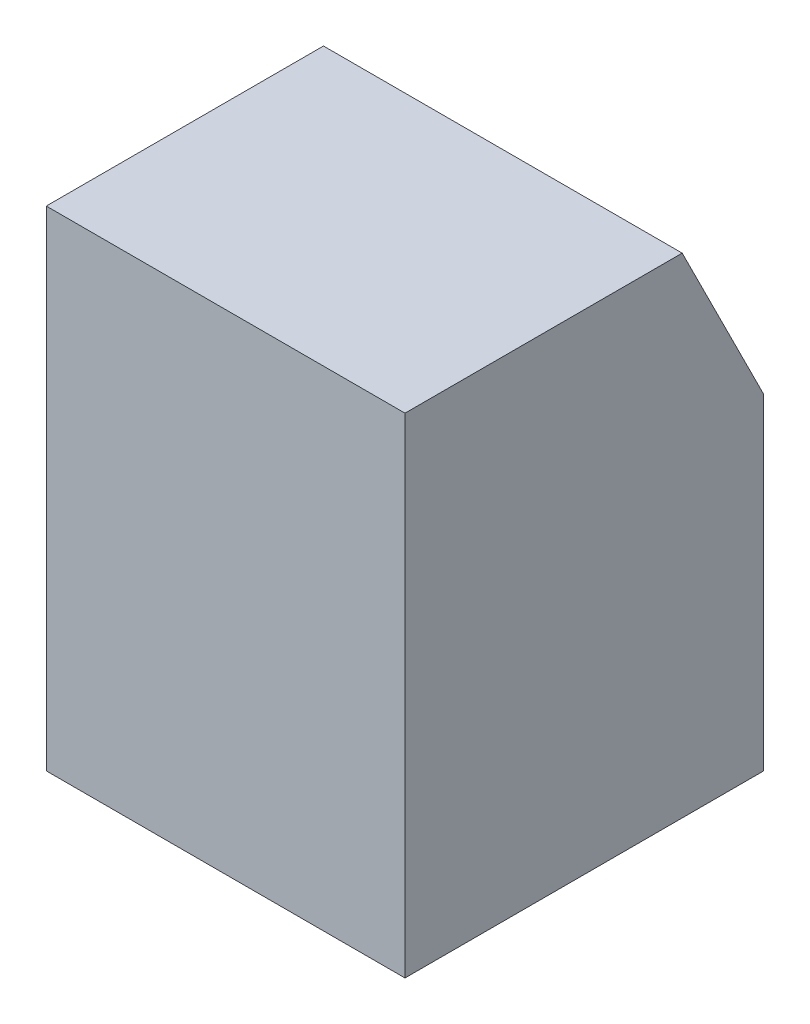
ISO-10303-21;
HEADER;
FILE_DESCRIPTION(('STEP AP214'),'2;1');
FILE_NAME('part.step','',(''),(''),'','','');
FILE_SCHEMA(('AUTOMOTIVE_DESIGN { 1 0 10303 214 1 1 1 1 }'));
ENDSEC;
DATA;
#1=APPLICATION_CONTEXT('core data for automotive mechanical design processes');
#2=APPLICATION_PROTOCOL_DEFINITION('international standard','automotive_design',2000,#1);
#3=PRODUCT_CONTEXT('',#1,'mechanical');
#4=PRODUCT('Part','Part','',(#3));
#5=PRODUCT_RELATED_PRODUCT_CATEGORY('part','',(#4));
#6=PRODUCT_DEFINITION_FORMATION('','',#4);
#7=PRODUCT_DEFINITION_CONTEXT('part definition',#1,'design');
#8=PRODUCT_DEFINITION('design','',#6,#7);
#9=PRODUCT_DEFINITION_SHAPE('','',#8);
#10=(LENGTH_UNIT() NAMED_UNIT(*) SI_UNIT(.MILLI.,.METRE.));
#11=(NAMED_UNIT(*) PLANE_ANGLE_UNIT() SI_UNIT($,.RADIAN.));
#12=(NAMED_UNIT(*) SI_UNIT($,.STERADIAN.) SOLID_ANGLE_UNIT());
#13=UNCERTAINTY_MEASURE_WITH_UNIT(LENGTH_MEASURE(1.E-05),#10,'distance_accuracy_value','');
#14=(GEOMETRIC_REPRESENTATION_CONTEXT(3) GLOBAL_UNCERTAINTY_ASSIGNED_CONTEXT((#13)) GLOBAL_UNIT_ASSIGNED_CONTEXT((#10,
#11,#12)) REPRESENTATION_CONTEXT('',''));
#15=CARTESIAN_POINT('',(0.,0.,0.));
#16=DIRECTION('',(0.,0.,1.));
#17=DIRECTION('',(1.,0.,0.));
#18=AXIS2_PLACEMENT_3D('',#15,#16,#17);
#19=CARTESIAN_POINT('',(279.4,381.,0.));
#20=DIRECTION('',(0.,0.,-1.));
#21=DIRECTION('',(0.,1.,0.));
#22=AXIS2_PLACEMENT_3D('',#19,#20,#21);
#23=PLANE('',#22);
#24=DIRECTION('',(0.,-1.,0.));
#25=VECTOR('',#24,1.);
#26=CARTESIAN_POINT('',(0.,381.,0.));
#27=LINE('',#26,#25);
#28=CARTESIAN_POINT('',(0.,381.,0.));
#29=VERTEX_POINT('',#28);
#30=CARTESIAN_POINT('',(0.,0.,0.));
#31=VERTEX_POINT('',#30);
#32=EDGE_CURVE('E108',#29,#31,#27,.T.);
#33=ORIENTED_EDGE('',*,*,#32,.T.);
#34=DIRECTION('',(-1.,0.,0.));
#35=VECTOR('',#34,1.);
#36=CARTESIAN_POINT('',(279.4,0.,0.));
#37=LINE('',#36,#35);
#38=CARTESIAN_POINT('',(279.4,0.,0.));
#39=VERTEX_POINT('',#38);
#40=EDGE_CURVE('E11',#39,#31,#37,.T.);
#41=ORIENTED_EDGE('',*,*,#40,.F.);
#42=DIRECTION('',(0.,-1.,0.));
#43=VECTOR('',#42,1.);
#44=CARTESIAN_POINT('',(279.4,381.,0.));
#45=LINE('',#44,#43);
#46=CARTESIAN_POINT('',(279.4,381.,0.));
#47=VERTEX_POINT('',#46);
#48=EDGE_CURVE('E117',#47,#39,#45,.T.);
#49=ORIENTED_EDGE('',*,*,#48,.F.);
#50=DIRECTION('',(-1.,0.,0.));
#51=VECTOR('',#50,1.);
#52=CARTESIAN_POINT('',(279.4,381.,0.));
#53=LINE('',#52,#51);
#54=EDGE_CURVE('E104',#47,#29,#53,.T.);
#55=ORIENTED_EDGE('',*,*,#54,.T.);
#56=EDGE_LOOP('',(#33,#41,#49,#55));
#57=FACE_BOUND('',#56,.T.);
#58=ADVANCED_FACE('F34',(#57),#23,.F.);
#59=CARTESIAN_POINT('',(279.4,0.,0.));
#60=DIRECTION('',(0.,1.,0.));
#61=DIRECTION('',(0.,0.,1.));
#62=AXIS2_PLACEMENT_3D('',#59,#60,#61);
#63=PLANE('',#62);
#64=DIRECTION('',(0.,0.,-1.));
#65=VECTOR('',#64,1.);
#66=CARTESIAN_POINT('',(0.,0.,0.));
#67=LINE('',#66,#65);
#68=CARTESIAN_POINT('',(0.,0.,-279.4));
#69=VERTEX_POINT('',#68);
#70=EDGE_CURVE('E111',#31,#69,#67,.T.);
#71=ORIENTED_EDGE('',*,*,#70,.T.);
#72=DIRECTION('',(-1.,0.,0.));
#73=VECTOR('',#72,1.);
#74=CARTESIAN_POINT('',(279.4,0.,-279.4));
#75=LINE('',#74,#73);
#76=CARTESIAN_POINT('',(279.4,0.,-279.4));
#77=VERTEX_POINT('',#76);
#78=EDGE_CURVE('E42',#77,#69,#75,.T.);
#79=ORIENTED_EDGE('',*,*,#78,.F.);
#80=DIRECTION('',(0.,0.,-1.));
#81=VECTOR('',#80,1.);
#82=CARTESIAN_POINT('',(279.4,0.,0.));
#83=LINE('',#82,#81);
#84=EDGE_CURVE('E84',#39,#77,#83,.T.);
#85=ORIENTED_EDGE('',*,*,#84,.F.);
#86=ORIENTED_EDGE('',*,*,#40,.T.);
#87=EDGE_LOOP('',(#71,#79,#85,#86));
#88=FACE_BOUND('',#87,.T.);
#89=ADVANCED_FACE('F136',(#88),#63,.F.);
#90=CARTESIAN_POINT('',(279.4,0.,-279.4));
#91=DIRECTION('',(0.,0.,1.));
#92=DIRECTION('',(1.,0.,0.));
#93=AXIS2_PLACEMENT_3D('',#90,#91,#92);
#94=PLANE('',#93);
#95=CARTESIAN_POINT('',(139.7,165.1,-279.4));
#96=DIRECTION('',(0.,0.,-1.));
#97=DIRECTION('',(-1.,0.,0.));
#98=AXIS2_PLACEMENT_3D('',#95,#96,#97);
#99=CIRCLE('',#98,12.7);
#100=CARTESIAN_POINT('',(127.,165.1,-279.4));
#101=VERTEX_POINT('',#100);
#102=EDGE_CURVE('E149',#101,#101,#99,.T.);
#103=ORIENTED_EDGE('',*,*,#102,.F.);
#104=EDGE_LOOP('',(#103));
#105=FACE_BOUND('',#104,.T.);
#106=DIRECTION('',(0.,1.,0.));
#107=VECTOR('',#106,1.);
#108=CARTESIAN_POINT('',(0.,0.,-279.4));
#109=LINE('',#108,#107);
#110=CARTESIAN_POINT('',(0.,254.,-279.4));
#111=VERTEX_POINT('',#110);
#112=EDGE_CURVE('E99',#69,#111,#109,.T.);
#113=ORIENTED_EDGE('',*,*,#112,.T.);
#114=DIRECTION('',(-1.,0.,0.));
#115=VECTOR('',#114,1.);
#116=CARTESIAN_POINT('',(279.4,254.,-279.4));
#117=LINE('',#116,#115);
#118=CARTESIAN_POINT('',(279.4,254.,-279.4));
#119=VERTEX_POINT('',#118);
#120=EDGE_CURVE('E96',#119,#111,#117,.T.);
#121=ORIENTED_EDGE('',*,*,#120,.F.);
#122=DIRECTION('',(0.,1.,0.));
#123=VECTOR('',#122,1.);
#124=CARTESIAN_POINT('',(279.4,0.,-279.4));
#125=LINE('',#124,#123);
#126=EDGE_CURVE('E88',#77,#119,#125,.T.);
#127=ORIENTED_EDGE('',*,*,#126,.F.);
#128=ORIENTED_EDGE('',*,*,#78,.T.);
#129=EDGE_LOOP('',(#113,#121,#127,#128));
#130=FACE_BOUND('',#129,.T.);
#131=ADVANCED_FACE('F97',(#105,#130),#94,.F.);
#132=CARTESIAN_POINT('',(279.4,254.,-279.4));
#133=DIRECTION('',(0.,-0.447213595499958,0.894427190999916));
#134=DIRECTION('',(0.,-0.894427190999916,-0.447213595499958));
#135=AXIS2_PLACEMENT_3D('',#132,#133,#134);
#136=PLANE('',#135);
#137=DIRECTION('',(0.,0.894427190999916,0.447213595499958));
#138=VECTOR('',#137,1.);
#139=CARTESIAN_POINT('',(0.,254.,-279.4));
#140=LINE('',#139,#138);
#141=CARTESIAN_POINT('',(0.,381.,-215.9));
#142=VERTEX_POINT('',#141);
#143=EDGE_CURVE('E70',#111,#142,#140,.T.);
#144=ORIENTED_EDGE('',*,*,#143,.T.);
#145=DIRECTION('',(-1.,0.,0.));
#146=VECTOR('',#145,1.);
#147=CARTESIAN_POINT('',(279.4,381.,-215.9));
#148=LINE('',#147,#146);
#149=CARTESIAN_POINT('',(279.4,381.,-215.9));
#150=VERTEX_POINT('',#149);
#151=EDGE_CURVE('E100',#150,#142,#148,.T.);
#152=ORIENTED_EDGE('',*,*,#151,.F.);
#153=DIRECTION('',(0.,0.894427190999916,0.447213595499958));
#154=VECTOR('',#153,1.);
#155=CARTESIAN_POINT('',(279.4,254.,-279.4));
#156=LINE('',#155,#154);
#157=EDGE_CURVE('E92',#119,#150,#156,.T.);
#158=ORIENTED_EDGE('',*,*,#157,.F.);
#159=ORIENTED_EDGE('',*,*,#120,.T.);
#160=EDGE_LOOP('',(#144,#152,#158,#159));
#161=FACE_BOUND('',#160,.T.);
#162=ADVANCED_FACE('F102',(#161),#136,.F.);
#163=CARTESIAN_POINT('',(279.4,381.,-215.9));
#164=DIRECTION('',(0.,-1.,0.));
#165=DIRECTION('',(0.,0.,-1.));
#166=AXIS2_PLACEMENT_3D('',#163,#164,#165);
#167=PLANE('',#166);
#168=DIRECTION('',(0.,0.,1.));
#169=VECTOR('',#168,1.);
#170=CARTESIAN_POINT('',(0.,381.,-215.9));
#171=LINE('',#170,#169);
#172=EDGE_CURVE('E76',#142,#29,#171,.T.);
#173=ORIENTED_EDGE('',*,*,#172,.T.);
#174=ORIENTED_EDGE('',*,*,#54,.F.);
#175=DIRECTION('',(0.,0.,1.));
#176=VECTOR('',#175,1.);
#177=CARTESIAN_POINT('',(279.4,381.,-215.9));
#178=LINE('',#177,#176);
#179=EDGE_CURVE('E50',#150,#47,#178,.T.);
#180=ORIENTED_EDGE('',*,*,#179,.F.);
#181=ORIENTED_EDGE('',*,*,#151,.T.);
#182=EDGE_LOOP('',(#173,#174,#180,#181));
#183=FACE_BOUND('',#182,.T.);
#184=ADVANCED_FACE('F125',(#183),#167,.F.);
#185=CARTESIAN_POINT('',(279.4,0.,0.));
#186=DIRECTION('',(1.,0.,0.));
#187=DIRECTION('',(0.,0.,-1.));
#188=AXIS2_PLACEMENT_3D('',#185,#186,#187);
#189=PLANE('',#188);
#190=ORIENTED_EDGE('',*,*,#48,.T.);
#191=ORIENTED_EDGE('',*,*,#84,.T.);
#192=ORIENTED_EDGE('',*,*,#126,.T.);
#193=ORIENTED_EDGE('',*,*,#157,.T.);
#194=ORIENTED_EDGE('',*,*,#179,.T.);
#195=EDGE_LOOP('',(#190,#191,#192,#193,#194));
#196=FACE_BOUND('',#195,.T.);
#197=ADVANCED_FACE('F90',(#196),#189,.T.);
#198=CARTESIAN_POINT('',(0.,0.,0.));
#199=DIRECTION('',(1.,0.,0.));
#200=DIRECTION('',(0.,0.,-1.));
#201=AXIS2_PLACEMENT_3D('',#198,#199,#200);
#202=PLANE('',#201);
#203=ORIENTED_EDGE('',*,*,#32,.F.);
#204=ORIENTED_EDGE('',*,*,#172,.F.);
#205=ORIENTED_EDGE('',*,*,#143,.F.);
#206=ORIENTED_EDGE('',*,*,#112,.F.);
#207=ORIENTED_EDGE('',*,*,#70,.F.);
#208=EDGE_LOOP('',(#203,#204,#205,#206,#207));
#209=FACE_BOUND('',#208,.T.);
#210=ADVANCED_FACE('F121',(#209),#202,.F.);
#211=CARTESIAN_POINT('',(139.7,165.1,-152.4));
#212=DIRECTION('',(0.,0.,-1.));
#213=DIRECTION('',(-1.,0.,0.));
#214=AXIS2_PLACEMENT_3D('',#211,#212,#213);
#215=CYLINDRICAL_SURFACE('',#214,12.7);
#216=CARTESIAN_POINT('',(139.7,165.1,-152.4));
#217=DIRECTION('',(0.,0.,-1.));
#218=DIRECTION('',(-1.,0.,0.));
#219=AXIS2_PLACEMENT_3D('',#216,#217,#218);
#220=CIRCLE('',#219,12.7);
#221=CARTESIAN_POINT('',(127.,165.1,-152.4));
#222=VERTEX_POINT('',#221);
#223=EDGE_CURVE('E112',#222,#222,#220,.T.);
#224=ORIENTED_EDGE('',*,*,#223,.F.);
#225=EDGE_LOOP('',(#224));
#226=FACE_BOUND('',#225,.T.);
#227=ORIENTED_EDGE('',*,*,#102,.T.);
#228=EDGE_LOOP('',(#227));
#229=FACE_BOUND('',#228,.T.);
#230=ADVANCED_FACE('F159',(#226,#229),#215,.F.);
#231=CARTESIAN_POINT('',(139.7,165.1,-152.4));
#232=DIRECTION('',(0.,0.,-1.));
#233=DIRECTION('',(-1.,0.,0.));
#234=AXIS2_PLACEMENT_3D('',#231,#232,#233);
#235=PLANE('',#234);
#236=ORIENTED_EDGE('',*,*,#223,.T.);
#237=EDGE_LOOP('',(#236));
#238=FACE_BOUND('',#237,.T.);
#239=ADVANCED_FACE('F157',(#238),#235,.T.);
#240=CLOSED_SHELL('',(#58,#89,#131,#162,#184,#197,#210,#230,#239));
#241=MANIFOLD_SOLID_BREP('B2',#240);
#242=ADVANCED_BREP_SHAPE_REPRESENTATION('',(#18,#241),#14);
#243=SHAPE_DEFINITION_REPRESENTATION(#9,#242);
ENDSEC;
END-ISO-10303-21;
